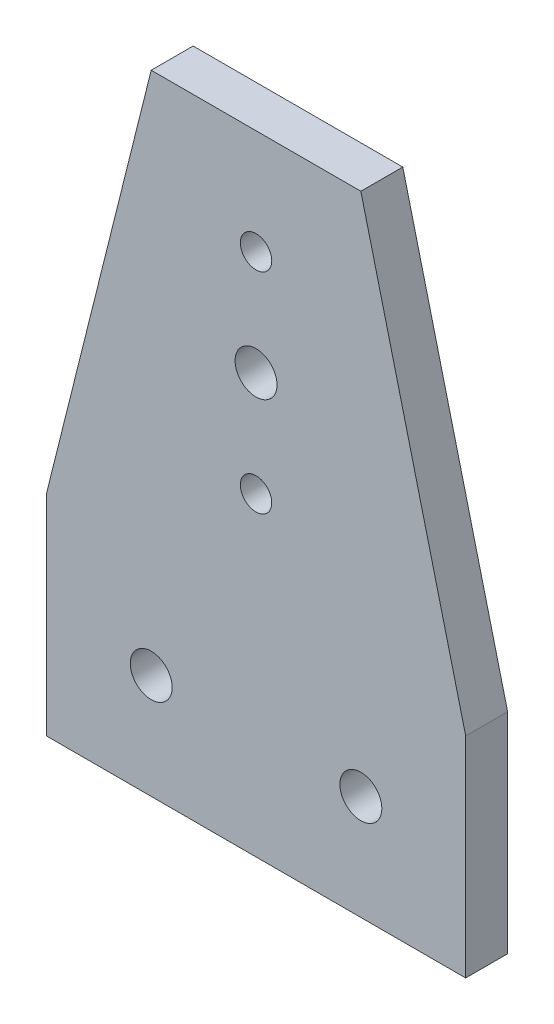
ISO-10303-21;
HEADER;
FILE_DESCRIPTION(('STEP AP214'),'2;1');
FILE_NAME('part.step','',(''),(''),'','','');
FILE_SCHEMA(('AUTOMOTIVE_DESIGN { 1 0 10303 214 1 1 1 1 }'));
ENDSEC;
DATA;
#1=APPLICATION_CONTEXT('core data for automotive mechanical design processes');
#2=APPLICATION_PROTOCOL_DEFINITION('international standard','automotive_design',2000,#1);
#3=PRODUCT_CONTEXT('',#1,'mechanical');
#4=PRODUCT('Part','Part','',(#3));
#5=PRODUCT_RELATED_PRODUCT_CATEGORY('part','',(#4));
#6=PRODUCT_DEFINITION_FORMATION('','',#4);
#7=PRODUCT_DEFINITION_CONTEXT('part definition',#1,'design');
#8=PRODUCT_DEFINITION('design','',#6,#7);
#9=PRODUCT_DEFINITION_SHAPE('','',#8);
#10=(LENGTH_UNIT() NAMED_UNIT(*) SI_UNIT(.MILLI.,.METRE.));
#11=(NAMED_UNIT(*) PLANE_ANGLE_UNIT() SI_UNIT($,.RADIAN.));
#12=(NAMED_UNIT(*) SI_UNIT($,.STERADIAN.) SOLID_ANGLE_UNIT());
#13=UNCERTAINTY_MEASURE_WITH_UNIT(LENGTH_MEASURE(1.E-05),#10,'distance_accuracy_value','');
#14=(GEOMETRIC_REPRESENTATION_CONTEXT(3) GLOBAL_UNCERTAINTY_ASSIGNED_CONTEXT((#13)) GLOBAL_UNIT_ASSIGNED_CONTEXT((#10,
#11,#12)) REPRESENTATION_CONTEXT('',''));
#15=CARTESIAN_POINT('',(0.,0.,0.));
#16=DIRECTION('',(0.,0.,1.));
#17=DIRECTION('',(1.,0.,0.));
#18=AXIS2_PLACEMENT_3D('',#15,#16,#17);
#19=CARTESIAN_POINT('',(-63.6421033287829,-7.69662921348313,8.));
#20=DIRECTION('',(1.,0.,0.));
#21=DIRECTION('',(0.,0.,-1.));
#22=AXIS2_PLACEMENT_3D('',#19,#20,#21);
#23=PLANE('',#22);
#24=DIRECTION('',(0.,-1.,0.));
#25=VECTOR('',#24,1.);
#26=CARTESIAN_POINT('',(-63.6421033287829,-7.69662921348313,0.));
#27=LINE('',#26,#25);
#28=CARTESIAN_POINT('',(-63.6421033287829,-7.69662921348313,0.));
#29=VERTEX_POINT('',#28);
#30=CARTESIAN_POINT('',(-63.6421033287829,-47.6966292134831,0.));
#31=VERTEX_POINT('',#30);
#32=EDGE_CURVE('E117',#29,#31,#27,.T.);
#33=ORIENTED_EDGE('',*,*,#32,.T.);
#34=DIRECTION('',(0.,0.,-1.));
#35=VECTOR('',#34,1.);
#36=CARTESIAN_POINT('',(-63.6421033287829,-47.6966292134831,8.));
#37=LINE('',#36,#35);
#38=CARTESIAN_POINT('',(-63.6421033287829,-47.6966292134831,8.));
#39=VERTEX_POINT('',#38);
#40=EDGE_CURVE('E11',#39,#31,#37,.T.);
#41=ORIENTED_EDGE('',*,*,#40,.F.);
#42=DIRECTION('',(0.,-1.,0.));
#43=VECTOR('',#42,1.);
#44=CARTESIAN_POINT('',(-63.6421033287829,-7.69662921348313,8.));
#45=LINE('',#44,#43);
#46=CARTESIAN_POINT('',(-63.6421033287829,-7.69662921348313,8.));
#47=VERTEX_POINT('',#46);
#48=EDGE_CURVE('E128',#47,#39,#45,.T.);
#49=ORIENTED_EDGE('',*,*,#48,.F.);
#50=DIRECTION('',(0.,0.,-1.));
#51=VECTOR('',#50,1.);
#52=CARTESIAN_POINT('',(-63.6421033287829,-7.69662921348313,8.));
#53=LINE('',#52,#51);
#54=EDGE_CURVE('E113',#47,#29,#53,.T.);
#55=ORIENTED_EDGE('',*,*,#54,.T.);
#56=EDGE_LOOP('',(#33,#41,#49,#55));
#57=FACE_BOUND('',#56,.T.);
#58=ADVANCED_FACE('F33',(#57),#23,.F.);
#59=CARTESIAN_POINT('',(-63.6421033287829,-47.6966292134831,8.));
#60=DIRECTION('',(0.,1.,0.));
#61=DIRECTION('',(0.,0.,1.));
#62=AXIS2_PLACEMENT_3D('',#59,#60,#61);
#63=PLANE('',#62);
#64=DIRECTION('',(1.,0.,0.));
#65=VECTOR('',#64,1.);
#66=CARTESIAN_POINT('',(-63.6421033287829,-47.6966292134831,0.));
#67=LINE('',#66,#65);
#68=CARTESIAN_POINT('',(16.3578966712171,-47.6966292134831,0.));
#69=VERTEX_POINT('',#68);
#70=EDGE_CURVE('E120',#31,#69,#67,.T.);
#71=ORIENTED_EDGE('',*,*,#70,.T.);
#72=DIRECTION('',(0.,0.,-1.));
#73=VECTOR('',#72,1.);
#74=CARTESIAN_POINT('',(16.3578966712171,-47.6966292134831,8.));
#75=LINE('',#74,#73);
#76=CARTESIAN_POINT('',(16.3578966712171,-47.6966292134831,8.));
#77=VERTEX_POINT('',#76);
#78=EDGE_CURVE('E41',#77,#69,#75,.T.);
#79=ORIENTED_EDGE('',*,*,#78,.F.);
#80=DIRECTION('',(1.,0.,0.));
#81=VECTOR('',#80,1.);
#82=CARTESIAN_POINT('',(-63.6421033287829,-47.6966292134831,8.));
#83=LINE('',#82,#81);
#84=EDGE_CURVE('E86',#39,#77,#83,.T.);
#85=ORIENTED_EDGE('',*,*,#84,.F.);
#86=ORIENTED_EDGE('',*,*,#40,.T.);
#87=EDGE_LOOP('',(#71,#79,#85,#86));
#88=FACE_BOUND('',#87,.T.);
#89=ADVANCED_FACE('F153',(#88),#63,.F.);
#90=CARTESIAN_POINT('',(16.3578966712171,-47.6966292134831,8.));
#91=DIRECTION('',(-1.,0.,0.));
#92=DIRECTION('',(0.,0.,1.));
#93=AXIS2_PLACEMENT_3D('',#90,#91,#92);
#94=PLANE('',#93);
#95=DIRECTION('',(0.,1.,0.));
#96=VECTOR('',#95,1.);
#97=CARTESIAN_POINT('',(16.3578966712171,-47.6966292134831,0.));
#98=LINE('',#97,#96);
#99=CARTESIAN_POINT('',(16.3578966712171,-7.69662921348313,0.));
#100=VERTEX_POINT('',#99);
#101=EDGE_CURVE('E123',#69,#100,#98,.T.);
#102=ORIENTED_EDGE('',*,*,#101,.T.);
#103=DIRECTION('',(0.,0.,-1.));
#104=VECTOR('',#103,1.);
#105=CARTESIAN_POINT('',(16.3578966712171,-7.69662921348313,8.));
#106=LINE('',#105,#104);
#107=CARTESIAN_POINT('',(16.3578966712171,-7.69662921348313,8.));
#108=VERTEX_POINT('',#107);
#109=EDGE_CURVE('E108',#108,#100,#106,.T.);
#110=ORIENTED_EDGE('',*,*,#109,.F.);
#111=DIRECTION('',(0.,1.,0.));
#112=VECTOR('',#111,1.);
#113=CARTESIAN_POINT('',(16.3578966712171,-47.6966292134831,8.));
#114=LINE('',#113,#112);
#115=EDGE_CURVE('E99',#77,#108,#114,.T.);
#116=ORIENTED_EDGE('',*,*,#115,.F.);
#117=ORIENTED_EDGE('',*,*,#78,.T.);
#118=EDGE_LOOP('',(#102,#110,#116,#117));
#119=FACE_BOUND('',#118,.T.);
#120=ADVANCED_FACE('F134',(#119),#94,.F.);
#121=CARTESIAN_POINT('',(16.3578966712171,-7.69662921348313,8.));
#122=DIRECTION('',(-0.970142500145332,-0.242535625036333,0.));
#123=DIRECTION('',(0.242535625036333,-0.970142500145332,0.));
#124=AXIS2_PLACEMENT_3D('',#121,#122,#123);
#125=PLANE('',#124);
#126=DIRECTION('',(-0.242535625036333,0.970142500145332,0.));
#127=VECTOR('',#126,1.);
#128=CARTESIAN_POINT('',(16.3578966712171,-7.69662921348313,0.));
#129=LINE('',#128,#127);
#130=CARTESIAN_POINT('',(-3.64210332878293,72.3033707865168,0.));
#131=VERTEX_POINT('',#130);
#132=EDGE_CURVE('E107',#100,#131,#129,.T.);
#133=ORIENTED_EDGE('',*,*,#132,.T.);
#134=DIRECTION('',(0.,0.,-1.));
#135=VECTOR('',#134,1.);
#136=CARTESIAN_POINT('',(-3.64210332878293,72.3033707865168,8.));
#137=LINE('',#136,#135);
#138=CARTESIAN_POINT('',(-3.64210332878293,72.3033707865168,8.));
#139=VERTEX_POINT('',#138);
#140=EDGE_CURVE('E104',#139,#131,#137,.T.);
#141=ORIENTED_EDGE('',*,*,#140,.F.);
#142=DIRECTION('',(-0.242535625036333,0.970142500145332,0.));
#143=VECTOR('',#142,1.);
#144=CARTESIAN_POINT('',(16.3578966712171,-7.69662921348313,8.));
#145=LINE('',#144,#143);
#146=EDGE_CURVE('E93',#108,#139,#145,.T.);
#147=ORIENTED_EDGE('',*,*,#146,.F.);
#148=ORIENTED_EDGE('',*,*,#109,.T.);
#149=EDGE_LOOP('',(#133,#141,#147,#148));
#150=FACE_BOUND('',#149,.T.);
#151=ADVANCED_FACE('F105',(#150),#125,.F.);
#152=CARTESIAN_POINT('',(-3.64210332878293,72.3033707865168,8.));
#153=DIRECTION('',(0.,-1.,0.));
#154=DIRECTION('',(1.,0.,0.));
#155=AXIS2_PLACEMENT_3D('',#152,#153,#154);
#156=PLANE('',#155);
#157=DIRECTION('',(-1.,0.,0.));
#158=VECTOR('',#157,1.);
#159=CARTESIAN_POINT('',(-3.64210332878293,72.3033707865168,0.));
#160=LINE('',#159,#158);
#161=CARTESIAN_POINT('',(-43.6421033287829,72.3033707865169,0.));
#162=VERTEX_POINT('',#161);
#163=EDGE_CURVE('E72',#131,#162,#160,.T.);
#164=ORIENTED_EDGE('',*,*,#163,.T.);
#165=DIRECTION('',(0.,0.,-1.));
#166=VECTOR('',#165,1.);
#167=CARTESIAN_POINT('',(-43.6421033287829,72.3033707865169,8.));
#168=LINE('',#167,#166);
#169=CARTESIAN_POINT('',(-43.6421033287829,72.3033707865169,8.));
#170=VERTEX_POINT('',#169);
#171=EDGE_CURVE('E109',#170,#162,#168,.T.);
#172=ORIENTED_EDGE('',*,*,#171,.F.);
#173=DIRECTION('',(-1.,0.,0.));
#174=VECTOR('',#173,1.);
#175=CARTESIAN_POINT('',(-3.64210332878293,72.3033707865168,8.));
#176=LINE('',#175,#174);
#177=EDGE_CURVE('E97',#139,#170,#176,.T.);
#178=ORIENTED_EDGE('',*,*,#177,.F.);
#179=ORIENTED_EDGE('',*,*,#140,.T.);
#180=EDGE_LOOP('',(#164,#172,#178,#179));
#181=FACE_BOUND('',#180,.T.);
#182=ADVANCED_FACE('F111',(#181),#156,.F.);
#183=CARTESIAN_POINT('',(-43.6421033287829,72.3033707865169,8.));
#184=DIRECTION('',(0.970142500145332,-0.242535625036333,0.));
#185=DIRECTION('',(0.242535625036333,0.970142500145332,0.));
#186=AXIS2_PLACEMENT_3D('',#183,#184,#185);
#187=PLANE('',#186);
#188=DIRECTION('',(-0.242535625036333,-0.970142500145332,0.));
#189=VECTOR('',#188,1.);
#190=CARTESIAN_POINT('',(-43.6421033287829,72.3033707865169,0.));
#191=LINE('',#190,#189);
#192=EDGE_CURVE('E78',#162,#29,#191,.T.);
#193=ORIENTED_EDGE('',*,*,#192,.T.);
#194=ORIENTED_EDGE('',*,*,#54,.F.);
#195=DIRECTION('',(-0.242535625036333,-0.970142500145332,0.));
#196=VECTOR('',#195,1.);
#197=CARTESIAN_POINT('',(-43.6421033287829,72.3033707865169,8.));
#198=LINE('',#197,#196);
#199=EDGE_CURVE('E49',#170,#47,#198,.T.);
#200=ORIENTED_EDGE('',*,*,#199,.F.);
#201=ORIENTED_EDGE('',*,*,#171,.T.);
#202=EDGE_LOOP('',(#193,#194,#200,#201));
#203=FACE_BOUND('',#202,.T.);
#204=ADVANCED_FACE('F141',(#203),#187,.F.);
#205=CARTESIAN_POINT('',(0.,0.,8.));
#206=DIRECTION('',(0.,0.,1.));
#207=DIRECTION('',(1.,0.,0.));
#208=AXIS2_PLACEMENT_3D('',#205,#206,#207);
#209=PLANE('',#208);
#210=CARTESIAN_POINT('',(-3.64210332878294,-27.6966292134831,8.));
#211=DIRECTION('',(0.,0.,1.));
#212=DIRECTION('',(1.,0.,0.));
#213=AXIS2_PLACEMENT_3D('',#210,#211,#212);
#214=CIRCLE('',#213,4.);
#215=CARTESIAN_POINT('',(0.357896671217061,-27.6966292134831,8.));
#216=VERTEX_POINT('',#215);
#217=EDGE_CURVE('E249',#216,#216,#214,.T.);
#218=ORIENTED_EDGE('',*,*,#217,.F.);
#219=EDGE_LOOP('',(#218));
#220=FACE_BOUND('',#219,.T.);
#221=CARTESIAN_POINT('',(-43.6421033287829,-27.6966292134831,8.));
#222=DIRECTION('',(0.,0.,1.));
#223=DIRECTION('',(1.,0.,0.));
#224=AXIS2_PLACEMENT_3D('',#221,#222,#223);
#225=CIRCLE('',#224,4.00000000000001);
#226=CARTESIAN_POINT('',(-39.6421033287829,-27.6966292134831,8.));
#227=VERTEX_POINT('',#226);
#228=EDGE_CURVE('E251',#227,#227,#225,.T.);
#229=ORIENTED_EDGE('',*,*,#228,.F.);
#230=EDGE_LOOP('',(#229));
#231=FACE_BOUND('',#230,.T.);
#232=CARTESIAN_POINT('',(-23.6421033287829,12.3033707865169,8.));
#233=DIRECTION('',(0.,0.,1.));
#234=DIRECTION('',(1.,0.,0.));
#235=AXIS2_PLACEMENT_3D('',#232,#233,#234);
#236=CIRCLE('',#235,3.);
#237=CARTESIAN_POINT('',(-20.6421033287829,12.3033707865169,8.));
#238=VERTEX_POINT('',#237);
#239=EDGE_CURVE('E257',#238,#238,#236,.T.);
#240=ORIENTED_EDGE('',*,*,#239,.F.);
#241=EDGE_LOOP('',(#240));
#242=FACE_BOUND('',#241,.T.);
#243=CARTESIAN_POINT('',(-23.6421033287829,32.3033707865169,8.));
#244=DIRECTION('',(0.,0.,1.));
#245=DIRECTION('',(1.,0.,0.));
#246=AXIS2_PLACEMENT_3D('',#243,#244,#245);
#247=CIRCLE('',#246,4.);
#248=CARTESIAN_POINT('',(-19.6421033287829,32.3033707865169,8.));
#249=VERTEX_POINT('',#248);
#250=EDGE_CURVE('E263',#249,#249,#247,.T.);
#251=ORIENTED_EDGE('',*,*,#250,.F.);
#252=EDGE_LOOP('',(#251));
#253=FACE_BOUND('',#252,.T.);
#254=CARTESIAN_POINT('',(-23.6421033287829,52.3033707865169,8.));
#255=DIRECTION('',(0.,0.,1.));
#256=DIRECTION('',(1.,0.,0.));
#257=AXIS2_PLACEMENT_3D('',#254,#255,#256);
#258=CIRCLE('',#257,3.);
#259=CARTESIAN_POINT('',(-20.6421033287829,52.3033707865169,8.));
#260=VERTEX_POINT('',#259);
#261=EDGE_CURVE('E269',#260,#260,#258,.T.);
#262=ORIENTED_EDGE('',*,*,#261,.F.);
#263=EDGE_LOOP('',(#262));
#264=FACE_BOUND('',#263,.T.);
#265=ORIENTED_EDGE('',*,*,#48,.T.);
#266=ORIENTED_EDGE('',*,*,#84,.T.);
#267=ORIENTED_EDGE('',*,*,#115,.T.);
#268=ORIENTED_EDGE('',*,*,#146,.T.);
#269=ORIENTED_EDGE('',*,*,#177,.T.);
#270=ORIENTED_EDGE('',*,*,#199,.T.);
#271=EDGE_LOOP('',(#265,#266,#267,#268,#269,#270));
#272=FACE_BOUND('',#271,.T.);
#273=ADVANCED_FACE('F95',(#220,#231,#242,#253,#264,#272),#209,.T.);
#274=CARTESIAN_POINT('',(0.,0.,0.));
#275=DIRECTION('',(0.,0.,1.));
#276=DIRECTION('',(1.,0.,0.));
#277=AXIS2_PLACEMENT_3D('',#274,#275,#276);
#278=PLANE('',#277);
#279=CARTESIAN_POINT('',(-3.64210332878294,-27.6966292134831,0.));
#280=DIRECTION('',(0.,0.,1.));
#281=DIRECTION('',(1.,0.,0.));
#282=AXIS2_PLACEMENT_3D('',#279,#280,#281);
#283=CIRCLE('',#282,4.);
#284=CARTESIAN_POINT('',(0.357896671217061,-27.6966292134831,0.));
#285=VERTEX_POINT('',#284);
#286=EDGE_CURVE('E246',#285,#285,#283,.T.);
#287=ORIENTED_EDGE('',*,*,#286,.T.);
#288=EDGE_LOOP('',(#287));
#289=FACE_BOUND('',#288,.T.);
#290=CARTESIAN_POINT('',(-43.6421033287829,-27.6966292134831,0.));
#291=DIRECTION('',(0.,0.,1.));
#292=DIRECTION('',(1.,0.,0.));
#293=AXIS2_PLACEMENT_3D('',#290,#291,#292);
#294=CIRCLE('',#293,4.00000000000001);
#295=CARTESIAN_POINT('',(-39.6421033287829,-27.6966292134831,0.));
#296=VERTEX_POINT('',#295);
#297=EDGE_CURVE('E254',#296,#296,#294,.T.);
#298=ORIENTED_EDGE('',*,*,#297,.T.);
#299=EDGE_LOOP('',(#298));
#300=FACE_BOUND('',#299,.T.);
#301=CARTESIAN_POINT('',(-23.6421033287829,12.3033707865169,0.));
#302=DIRECTION('',(0.,0.,1.));
#303=DIRECTION('',(1.,0.,0.));
#304=AXIS2_PLACEMENT_3D('',#301,#302,#303);
#305=CIRCLE('',#304,3.);
#306=CARTESIAN_POINT('',(-20.6421033287829,12.3033707865169,0.));
#307=VERTEX_POINT('',#306);
#308=EDGE_CURVE('E260',#307,#307,#305,.T.);
#309=ORIENTED_EDGE('',*,*,#308,.T.);
#310=EDGE_LOOP('',(#309));
#311=FACE_BOUND('',#310,.T.);
#312=CARTESIAN_POINT('',(-23.6421033287829,32.3033707865169,0.));
#313=DIRECTION('',(0.,0.,1.));
#314=DIRECTION('',(1.,0.,0.));
#315=AXIS2_PLACEMENT_3D('',#312,#313,#314);
#316=CIRCLE('',#315,4.);
#317=CARTESIAN_POINT('',(-19.6421033287829,32.3033707865169,0.));
#318=VERTEX_POINT('',#317);
#319=EDGE_CURVE('E266',#318,#318,#316,.T.);
#320=ORIENTED_EDGE('',*,*,#319,.T.);
#321=EDGE_LOOP('',(#320));
#322=FACE_BOUND('',#321,.T.);
#323=CARTESIAN_POINT('',(-23.6421033287829,52.3033707865169,0.));
#324=DIRECTION('',(0.,0.,1.));
#325=DIRECTION('',(1.,0.,0.));
#326=AXIS2_PLACEMENT_3D('',#323,#324,#325);
#327=CIRCLE('',#326,3.);
#328=CARTESIAN_POINT('',(-20.6421033287829,52.3033707865169,0.));
#329=VERTEX_POINT('',#328);
#330=EDGE_CURVE('E121',#329,#329,#327,.T.);
#331=ORIENTED_EDGE('',*,*,#330,.T.);
#332=EDGE_LOOP('',(#331));
#333=FACE_BOUND('',#332,.T.);
#334=ORIENTED_EDGE('',*,*,#32,.F.);
#335=ORIENTED_EDGE('',*,*,#192,.F.);
#336=ORIENTED_EDGE('',*,*,#163,.F.);
#337=ORIENTED_EDGE('',*,*,#132,.F.);
#338=ORIENTED_EDGE('',*,*,#101,.F.);
#339=ORIENTED_EDGE('',*,*,#70,.F.);
#340=EDGE_LOOP('',(#334,#335,#336,#337,#338,#339));
#341=FACE_BOUND('',#340,.T.);
#342=ADVANCED_FACE('F137',(#289,#300,#311,#322,#333,#341),#278,.F.);
#343=CARTESIAN_POINT('',(-23.6421033287829,52.3033707865169,0.));
#344=DIRECTION('',(0.,0.,1.));
#345=DIRECTION('',(1.,0.,0.));
#346=AXIS2_PLACEMENT_3D('',#343,#344,#345);
#347=CYLINDRICAL_SURFACE('',#346,3.);
#348=ORIENTED_EDGE('',*,*,#330,.F.);
#349=EDGE_LOOP('',(#348));
#350=FACE_BOUND('',#349,.T.);
#351=ORIENTED_EDGE('',*,*,#261,.T.);
#352=EDGE_LOOP('',(#351));
#353=FACE_BOUND('',#352,.T.);
#354=ADVANCED_FACE('F190',(#350,#353),#347,.F.);
#355=CARTESIAN_POINT('',(-23.6421033287829,32.3033707865169,0.));
#356=DIRECTION('',(0.,0.,1.));
#357=DIRECTION('',(1.,0.,0.));
#358=AXIS2_PLACEMENT_3D('',#355,#356,#357);
#359=CYLINDRICAL_SURFACE('',#358,4.);
#360=ORIENTED_EDGE('',*,*,#319,.F.);
#361=EDGE_LOOP('',(#360));
#362=FACE_BOUND('',#361,.T.);
#363=ORIENTED_EDGE('',*,*,#250,.T.);
#364=EDGE_LOOP('',(#363));
#365=FACE_BOUND('',#364,.T.);
#366=ADVANCED_FACE('F199',(#362,#365),#359,.F.);
#367=CARTESIAN_POINT('',(-23.6421033287829,12.3033707865169,0.));
#368=DIRECTION('',(0.,0.,1.));
#369=DIRECTION('',(1.,0.,0.));
#370=AXIS2_PLACEMENT_3D('',#367,#368,#369);
#371=CYLINDRICAL_SURFACE('',#370,3.);
#372=ORIENTED_EDGE('',*,*,#308,.F.);
#373=EDGE_LOOP('',(#372));
#374=FACE_BOUND('',#373,.T.);
#375=ORIENTED_EDGE('',*,*,#239,.T.);
#376=EDGE_LOOP('',(#375));
#377=FACE_BOUND('',#376,.T.);
#378=ADVANCED_FACE('F209',(#374,#377),#371,.F.);
#379=CARTESIAN_POINT('',(-43.6421033287829,-27.6966292134831,0.));
#380=DIRECTION('',(0.,0.,1.));
#381=DIRECTION('',(1.,0.,0.));
#382=AXIS2_PLACEMENT_3D('',#379,#380,#381);
#383=CYLINDRICAL_SURFACE('',#382,4.00000000000001);
#384=ORIENTED_EDGE('',*,*,#297,.F.);
#385=EDGE_LOOP('',(#384));
#386=FACE_BOUND('',#385,.T.);
#387=ORIENTED_EDGE('',*,*,#228,.T.);
#388=EDGE_LOOP('',(#387));
#389=FACE_BOUND('',#388,.T.);
#390=ADVANCED_FACE('F219',(#386,#389),#383,.F.);
#391=CARTESIAN_POINT('',(-3.64210332878294,-27.6966292134831,0.));
#392=DIRECTION('',(0.,0.,1.));
#393=DIRECTION('',(1.,0.,0.));
#394=AXIS2_PLACEMENT_3D('',#391,#392,#393);
#395=CYLINDRICAL_SURFACE('',#394,4.);
#396=ORIENTED_EDGE('',*,*,#286,.F.);
#397=EDGE_LOOP('',(#396));
#398=FACE_BOUND('',#397,.T.);
#399=ORIENTED_EDGE('',*,*,#217,.T.);
#400=EDGE_LOOP('',(#399));
#401=FACE_BOUND('',#400,.T.);
#402=ADVANCED_FACE('F229',(#398,#401),#395,.F.);
#403=CLOSED_SHELL('',(#58,#89,#120,#151,#182,#204,#273,#342,#354,#366,#378,#390,#402));
#404=MANIFOLD_SOLID_BREP('B2',#403);
#405=ADVANCED_BREP_SHAPE_REPRESENTATION('',(#18,#404),#14);
#406=SHAPE_DEFINITION_REPRESENTATION(#9,#405);
ENDSEC;
END-ISO-10303-21;
